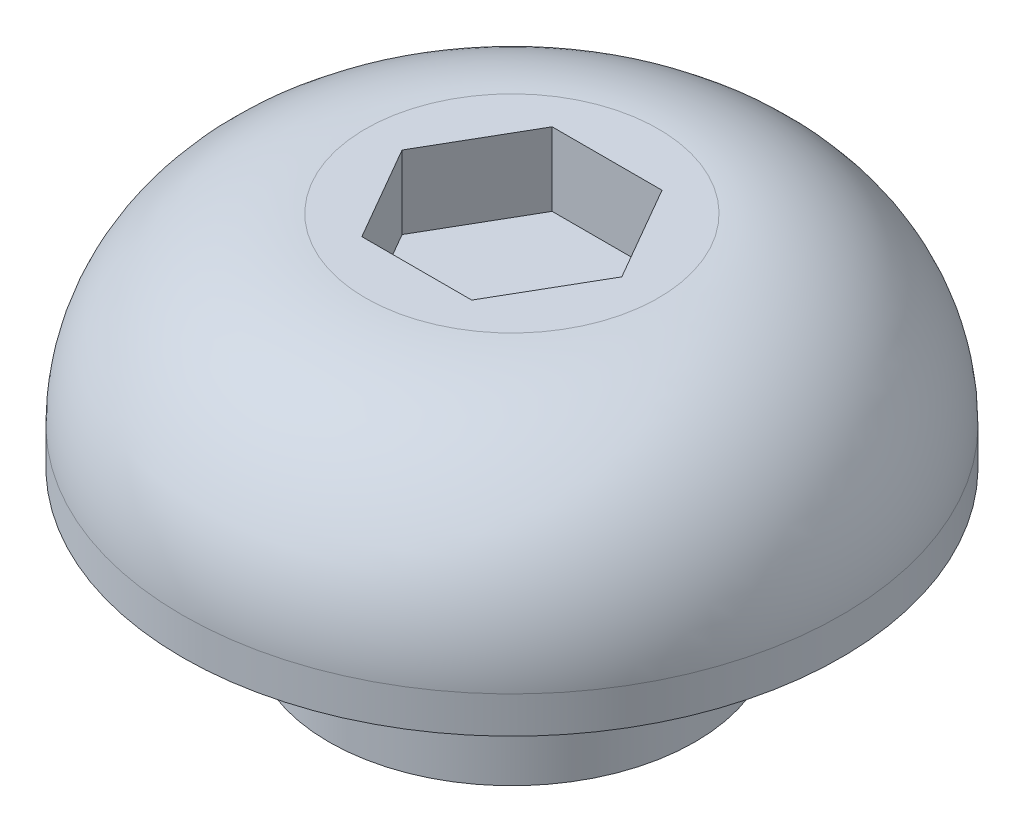
ISO-10303-21;
HEADER;
FILE_DESCRIPTION(('STEP AP214'),'2;1');
FILE_NAME('part.step','',(''),(''),'','','');
FILE_SCHEMA(('AUTOMOTIVE_DESIGN { 1 0 10303 214 1 1 1 1 }'));
ENDSEC;
DATA;
#1=APPLICATION_CONTEXT('core data for automotive mechanical design processes');
#2=APPLICATION_PROTOCOL_DEFINITION('international standard','automotive_design',2000,#1);
#3=PRODUCT_CONTEXT('',#1,'mechanical');
#4=PRODUCT('Part','Part','',(#3));
#5=PRODUCT_RELATED_PRODUCT_CATEGORY('part','',(#4));
#6=PRODUCT_DEFINITION_FORMATION('','',#4);
#7=PRODUCT_DEFINITION_CONTEXT('part definition',#1,'design');
#8=PRODUCT_DEFINITION('design','',#6,#7);
#9=PRODUCT_DEFINITION_SHAPE('','',#8);
#10=(LENGTH_UNIT() NAMED_UNIT(*) SI_UNIT(.MILLI.,.METRE.));
#11=(NAMED_UNIT(*) PLANE_ANGLE_UNIT() SI_UNIT($,.RADIAN.));
#12=(NAMED_UNIT(*) SI_UNIT($,.STERADIAN.) SOLID_ANGLE_UNIT());
#13=UNCERTAINTY_MEASURE_WITH_UNIT(LENGTH_MEASURE(1.E-05),#10,'distance_accuracy_value','');
#14=(GEOMETRIC_REPRESENTATION_CONTEXT(3) GLOBAL_UNCERTAINTY_ASSIGNED_CONTEXT((#13)) GLOBAL_UNIT_ASSIGNED_CONTEXT((#10,
#11,#12)) REPRESENTATION_CONTEXT('',''));
#15=CARTESIAN_POINT('',(0.,0.,0.));
#16=DIRECTION('',(0.,0.,1.));
#17=DIRECTION('',(1.,0.,0.));
#18=AXIS2_PLACEMENT_3D('',#15,#16,#17);
#19=CARTESIAN_POINT('',(0.,3.,0.));
#20=DIRECTION('',(0.,-1.,0.));
#21=DIRECTION('',(0.,0.,-1.));
#22=AXIS2_PLACEMENT_3D('',#19,#20,#21);
#23=CYLINDRICAL_SURFACE('',#22,4.5);
#24=CARTESIAN_POINT('',(0.,0.5,0.));
#25=DIRECTION('',(0.,1.,0.));
#26=DIRECTION('',(0.,0.,1.));
#27=AXIS2_PLACEMENT_3D('',#24,#25,#26);
#28=CIRCLE('',#27,4.5);
#29=CARTESIAN_POINT('',(0.,0.5,4.5));
#30=VERTEX_POINT('',#29);
#31=EDGE_CURVE('E36',#30,#30,#28,.F.);
#32=ORIENTED_EDGE('',*,*,#31,.T.);
#33=EDGE_LOOP('',(#32));
#34=FACE_BOUND('',#33,.T.);
#35=CARTESIAN_POINT('',(0.,0.,0.));
#36=DIRECTION('',(0.,1.,0.));
#37=DIRECTION('',(0.,0.,1.));
#38=AXIS2_PLACEMENT_3D('',#35,#36,#37);
#39=CIRCLE('',#38,4.5);
#40=CARTESIAN_POINT('',(0.,0.,4.5));
#41=VERTEX_POINT('',#40);
#42=EDGE_CURVE('E136',#41,#41,#39,.T.);
#43=ORIENTED_EDGE('',*,*,#42,.T.);
#44=EDGE_LOOP('',(#43));
#45=FACE_BOUND('',#44,.T.);
#46=ADVANCED_FACE('F32',(#34,#45),#23,.T.);
#47=CARTESIAN_POINT('',(0.,3.,0.));
#48=DIRECTION('',(0.,1.,0.));
#49=DIRECTION('',(0.,0.,1.));
#50=AXIS2_PLACEMENT_3D('',#47,#48,#49);
#51=PLANE('',#50);
#52=DIRECTION('',(0.5,0.,-0.866025403784439));
#53=VECTOR('',#52,1.);
#54=CARTESIAN_POINT('',(0.750000000000001,3.,1.29903810567666));
#55=LINE('',#54,#53);
#56=CARTESIAN_POINT('',(0.750000000000001,3.,1.29903810567666));
#57=VERTEX_POINT('',#56);
#58=CARTESIAN_POINT('',(1.5,3.,0.));
#59=VERTEX_POINT('',#58);
#60=EDGE_CURVE('E48',#57,#59,#55,.T.);
#61=ORIENTED_EDGE('',*,*,#60,.F.);
#62=DIRECTION('',(1.,0.,0.));
#63=VECTOR('',#62,1.);
#64=CARTESIAN_POINT('',(-0.750000000000001,3.,1.29903810567666));
#65=LINE('',#64,#63);
#66=CARTESIAN_POINT('',(-0.750000000000001,3.,1.29903810567666));
#67=VERTEX_POINT('',#66);
#68=EDGE_CURVE('E132',#67,#57,#65,.T.);
#69=ORIENTED_EDGE('',*,*,#68,.F.);
#70=DIRECTION('',(0.5,0.,0.866025403784439));
#71=VECTOR('',#70,1.);
#72=CARTESIAN_POINT('',(-1.5,3.,0.));
#73=LINE('',#72,#71);
#74=CARTESIAN_POINT('',(-1.5,3.,0.));
#75=VERTEX_POINT('',#74);
#76=EDGE_CURVE('E130',#75,#67,#73,.T.);
#77=ORIENTED_EDGE('',*,*,#76,.F.);
#78=DIRECTION('',(-0.5,0.,0.866025403784439));
#79=VECTOR('',#78,1.);
#80=CARTESIAN_POINT('',(-0.750000000000001,3.,-1.29903810567666));
#81=LINE('',#80,#79);
#82=CARTESIAN_POINT('',(-0.750000000000001,3.,-1.29903810567666));
#83=VERTEX_POINT('',#82);
#84=EDGE_CURVE('E96',#83,#75,#81,.T.);
#85=ORIENTED_EDGE('',*,*,#84,.F.);
#86=DIRECTION('',(-1.,0.,0.));
#87=VECTOR('',#86,1.);
#88=CARTESIAN_POINT('',(0.749999999999999,3.,-1.29903810567666));
#89=LINE('',#88,#87);
#90=CARTESIAN_POINT('',(0.749999999999999,3.,-1.29903810567666));
#91=VERTEX_POINT('',#90);
#92=EDGE_CURVE('E126',#91,#83,#89,.T.);
#93=ORIENTED_EDGE('',*,*,#92,.F.);
#94=DIRECTION('',(-0.5,0.,-0.866025403784439));
#95=VECTOR('',#94,1.);
#96=CARTESIAN_POINT('',(1.5,3.,0.));
#97=LINE('',#96,#95);
#98=EDGE_CURVE('E122',#59,#91,#97,.T.);
#99=ORIENTED_EDGE('',*,*,#98,.F.);
#100=EDGE_LOOP('',(#61,#69,#77,#85,#93,#99));
#101=FACE_BOUND('',#100,.T.);
#102=CARTESIAN_POINT('',(0.,3.,0.));
#103=DIRECTION('',(0.,1.,0.));
#104=DIRECTION('',(0.,0.,1.));
#105=AXIS2_PLACEMENT_3D('',#102,#103,#104);
#106=CIRCLE('',#105,2.);
#107=CARTESIAN_POINT('',(0.,3.,2.));
#108=VERTEX_POINT('',#107);
#109=EDGE_CURVE('E143',#108,#108,#106,.T.);
#110=ORIENTED_EDGE('',*,*,#109,.T.);
#111=EDGE_LOOP('',(#110));
#112=FACE_BOUND('',#111,.T.);
#113=ADVANCED_FACE('F162',(#101,#112),#51,.T.);
#114=CARTESIAN_POINT('',(0.,0.,0.));
#115=DIRECTION('',(0.,1.,0.));
#116=DIRECTION('',(0.,0.,1.));
#117=AXIS2_PLACEMENT_3D('',#114,#115,#116);
#118=PLANE('',#117);
#119=CARTESIAN_POINT('',(0.,0.,0.));
#120=DIRECTION('',(0.,-1.,0.));
#121=DIRECTION('',(0.,0.,-1.));
#122=AXIS2_PLACEMENT_3D('',#119,#120,#121);
#123=CIRCLE('',#122,2.5);
#124=CARTESIAN_POINT('',(0.,0.,-2.5));
#125=VERTEX_POINT('',#124);
#126=EDGE_CURVE('E11',#125,#125,#123,.T.);
#127=ORIENTED_EDGE('',*,*,#126,.F.);
#128=EDGE_LOOP('',(#127));
#129=FACE_BOUND('',#128,.T.);
#130=ORIENTED_EDGE('',*,*,#42,.F.);
#131=EDGE_LOOP('',(#130));
#132=FACE_BOUND('',#131,.T.);
#133=ADVANCED_FACE('F155',(#129,#132),#118,.F.);
#134=CARTESIAN_POINT('',(0.,0.5,0.));
#135=DIRECTION('',(0.,1.,0.));
#136=DIRECTION('',(0.,0.,1.));
#137=AXIS2_PLACEMENT_3D('',#134,#135,#136);
#138=DEGENERATE_TOROIDAL_SURFACE('',#137,2.,2.5,.T.);
#139=ORIENTED_EDGE('',*,*,#31,.F.);
#140=EDGE_LOOP('',(#139));
#141=FACE_BOUND('',#140,.T.);
#142=ORIENTED_EDGE('',*,*,#109,.F.);
#143=EDGE_LOOP('',(#142));
#144=FACE_BOUND('',#143,.T.);
#145=ADVANCED_FACE('F34',(#141,#144),#138,.T.);
#146=CARTESIAN_POINT('',(0.750000000000001,2.,1.29903810567666));
#147=DIRECTION('',(0.866025403784439,0.,0.5));
#148=DIRECTION('',(0.5,0.,-0.866025403784439));
#149=AXIS2_PLACEMENT_3D('',#146,#147,#148);
#150=PLANE('',#149);
#151=ORIENTED_EDGE('',*,*,#60,.T.);
#152=DIRECTION('',(0.,1.,0.));
#153=VECTOR('',#152,1.);
#154=CARTESIAN_POINT('',(1.5,2.,0.));
#155=LINE('',#154,#153);
#156=CARTESIAN_POINT('',(1.5,2.,0.));
#157=VERTEX_POINT('',#156);
#158=EDGE_CURVE('E78',#157,#59,#155,.T.);
#159=ORIENTED_EDGE('',*,*,#158,.F.);
#160=DIRECTION('',(0.5,0.,-0.866025403784439));
#161=VECTOR('',#160,1.);
#162=CARTESIAN_POINT('',(0.750000000000001,2.,1.29903810567666));
#163=LINE('',#162,#161);
#164=CARTESIAN_POINT('',(0.750000000000001,2.,1.29903810567666));
#165=VERTEX_POINT('',#164);
#166=EDGE_CURVE('E134',#165,#157,#163,.T.);
#167=ORIENTED_EDGE('',*,*,#166,.F.);
#168=DIRECTION('',(0.,1.,0.));
#169=VECTOR('',#168,1.);
#170=CARTESIAN_POINT('',(0.750000000000001,2.,1.29903810567666));
#171=LINE('',#170,#169);
#172=EDGE_CURVE('E56',#165,#57,#171,.T.);
#173=ORIENTED_EDGE('',*,*,#172,.T.);
#174=EDGE_LOOP('',(#151,#159,#167,#173));
#175=FACE_BOUND('',#174,.T.);
#176=ADVANCED_FACE('F154',(#175),#150,.F.);
#177=CARTESIAN_POINT('',(-0.750000000000001,2.,1.29903810567666));
#178=DIRECTION('',(0.,0.,1.));
#179=DIRECTION('',(1.,0.,0.));
#180=AXIS2_PLACEMENT_3D('',#177,#178,#179);
#181=PLANE('',#180);
#182=ORIENTED_EDGE('',*,*,#68,.T.);
#183=ORIENTED_EDGE('',*,*,#172,.F.);
#184=DIRECTION('',(1.,0.,0.));
#185=VECTOR('',#184,1.);
#186=CARTESIAN_POINT('',(-0.750000000000001,2.,1.29903810567666));
#187=LINE('',#186,#185);
#188=CARTESIAN_POINT('',(-0.750000000000001,2.,1.29903810567666));
#189=VERTEX_POINT('',#188);
#190=EDGE_CURVE('E108',#189,#165,#187,.T.);
#191=ORIENTED_EDGE('',*,*,#190,.F.);
#192=DIRECTION('',(0.,1.,0.));
#193=VECTOR('',#192,1.);
#194=CARTESIAN_POINT('',(-0.750000000000001,2.,1.29903810567666));
#195=LINE('',#194,#193);
#196=EDGE_CURVE('E100',#189,#67,#195,.T.);
#197=ORIENTED_EDGE('',*,*,#196,.T.);
#198=EDGE_LOOP('',(#182,#183,#191,#197));
#199=FACE_BOUND('',#198,.T.);
#200=ADVANCED_FACE('F160',(#199),#181,.F.);
#201=CARTESIAN_POINT('',(-1.5,2.,0.));
#202=DIRECTION('',(-0.866025403784439,0.,0.5));
#203=DIRECTION('',(0.5,0.,0.866025403784439));
#204=AXIS2_PLACEMENT_3D('',#201,#202,#203);
#205=PLANE('',#204);
#206=ORIENTED_EDGE('',*,*,#76,.T.);
#207=ORIENTED_EDGE('',*,*,#196,.F.);
#208=DIRECTION('',(0.5,0.,0.866025403784439));
#209=VECTOR('',#208,1.);
#210=CARTESIAN_POINT('',(-1.5,2.,0.));
#211=LINE('',#210,#209);
#212=CARTESIAN_POINT('',(-1.5,2.,0.));
#213=VERTEX_POINT('',#212);
#214=EDGE_CURVE('E104',#213,#189,#211,.T.);
#215=ORIENTED_EDGE('',*,*,#214,.F.);
#216=DIRECTION('',(0.,1.,0.));
#217=VECTOR('',#216,1.);
#218=CARTESIAN_POINT('',(-1.5,2.,0.));
#219=LINE('',#218,#217);
#220=EDGE_CURVE('E89',#213,#75,#219,.T.);
#221=ORIENTED_EDGE('',*,*,#220,.T.);
#222=EDGE_LOOP('',(#206,#207,#215,#221));
#223=FACE_BOUND('',#222,.T.);
#224=ADVANCED_FACE('F105',(#223),#205,.F.);
#225=CARTESIAN_POINT('',(-0.750000000000001,2.,-1.29903810567666));
#226=DIRECTION('',(-0.866025403784439,0.,-0.5));
#227=DIRECTION('',(-0.5,0.,0.866025403784439));
#228=AXIS2_PLACEMENT_3D('',#225,#226,#227);
#229=PLANE('',#228);
#230=ORIENTED_EDGE('',*,*,#84,.T.);
#231=ORIENTED_EDGE('',*,*,#220,.F.);
#232=DIRECTION('',(-0.5,0.,0.866025403784439));
#233=VECTOR('',#232,1.);
#234=CARTESIAN_POINT('',(-0.750000000000001,2.,-1.29903810567666));
#235=LINE('',#234,#233);
#236=CARTESIAN_POINT('',(-0.750000000000001,2.,-1.29903810567666));
#237=VERTEX_POINT('',#236);
#238=EDGE_CURVE('E93',#237,#213,#235,.T.);
#239=ORIENTED_EDGE('',*,*,#238,.F.);
#240=DIRECTION('',(0.,1.,0.));
#241=VECTOR('',#240,1.);
#242=CARTESIAN_POINT('',(-0.750000000000001,2.,-1.29903810567666));
#243=LINE('',#242,#241);
#244=EDGE_CURVE('E101',#237,#83,#243,.T.);
#245=ORIENTED_EDGE('',*,*,#244,.T.);
#246=EDGE_LOOP('',(#230,#231,#239,#245));
#247=FACE_BOUND('',#246,.T.);
#248=ADVANCED_FACE('F91',(#247),#229,.F.);
#249=CARTESIAN_POINT('',(0.749999999999999,2.,-1.29903810567666));
#250=DIRECTION('',(0.,0.,-1.));
#251=DIRECTION('',(-1.,0.,0.));
#252=AXIS2_PLACEMENT_3D('',#249,#250,#251);
#253=PLANE('',#252);
#254=ORIENTED_EDGE('',*,*,#92,.T.);
#255=ORIENTED_EDGE('',*,*,#244,.F.);
#256=DIRECTION('',(-1.,0.,0.));
#257=VECTOR('',#256,1.);
#258=CARTESIAN_POINT('',(0.749999999999999,2.,-1.29903810567666));
#259=LINE('',#258,#257);
#260=CARTESIAN_POINT('',(0.749999999999999,2.,-1.29903810567666));
#261=VERTEX_POINT('',#260);
#262=EDGE_CURVE('E114',#261,#237,#259,.T.);
#263=ORIENTED_EDGE('',*,*,#262,.F.);
#264=DIRECTION('',(0.,1.,0.));
#265=VECTOR('',#264,1.);
#266=CARTESIAN_POINT('',(0.749999999999999,2.,-1.29903810567666));
#267=LINE('',#266,#265);
#268=EDGE_CURVE('E139',#261,#91,#267,.T.);
#269=ORIENTED_EDGE('',*,*,#268,.T.);
#270=EDGE_LOOP('',(#254,#255,#263,#269));
#271=FACE_BOUND('',#270,.T.);
#272=ADVANCED_FACE('F175',(#271),#253,.F.);
#273=CARTESIAN_POINT('',(1.5,2.,0.));
#274=DIRECTION('',(0.866025403784439,0.,-0.5));
#275=DIRECTION('',(-0.5,0.,-0.866025403784439));
#276=AXIS2_PLACEMENT_3D('',#273,#274,#275);
#277=PLANE('',#276);
#278=ORIENTED_EDGE('',*,*,#98,.T.);
#279=ORIENTED_EDGE('',*,*,#268,.F.);
#280=DIRECTION('',(-0.5,0.,-0.866025403784439));
#281=VECTOR('',#280,1.);
#282=CARTESIAN_POINT('',(1.5,2.,0.));
#283=LINE('',#282,#281);
#284=EDGE_CURVE('E116',#157,#261,#283,.T.);
#285=ORIENTED_EDGE('',*,*,#284,.F.);
#286=ORIENTED_EDGE('',*,*,#158,.T.);
#287=EDGE_LOOP('',(#278,#279,#285,#286));
#288=FACE_BOUND('',#287,.T.);
#289=ADVANCED_FACE('F172',(#288),#277,.F.);
#290=CARTESIAN_POINT('',(0.,2.,0.));
#291=DIRECTION('',(0.,1.,0.));
#292=DIRECTION('',(0.,0.,1.));
#293=AXIS2_PLACEMENT_3D('',#290,#291,#292);
#294=PLANE('',#293);
#295=ORIENTED_EDGE('',*,*,#166,.T.);
#296=ORIENTED_EDGE('',*,*,#284,.T.);
#297=ORIENTED_EDGE('',*,*,#262,.T.);
#298=ORIENTED_EDGE('',*,*,#238,.T.);
#299=ORIENTED_EDGE('',*,*,#214,.T.);
#300=ORIENTED_EDGE('',*,*,#190,.T.);
#301=EDGE_LOOP('',(#295,#296,#297,#298,#299,#300));
#302=FACE_BOUND('',#301,.T.);
#303=ADVANCED_FACE('F111',(#302),#294,.T.);
#304=CARTESIAN_POINT('',(0.,-2.,0.));
#305=DIRECTION('',(0.,1.,0.));
#306=DIRECTION('',(0.,0.,1.));
#307=AXIS2_PLACEMENT_3D('',#304,#305,#306);
#308=CYLINDRICAL_SURFACE('',#307,2.5);
#309=CARTESIAN_POINT('',(0.,-2.,0.));
#310=DIRECTION('',(0.,-1.,0.));
#311=DIRECTION('',(0.,0.,-1.));
#312=AXIS2_PLACEMENT_3D('',#309,#310,#311);
#313=CIRCLE('',#312,2.5);
#314=CARTESIAN_POINT('',(0.,-2.,-2.5));
#315=VERTEX_POINT('',#314);
#316=EDGE_CURVE('E123',#315,#315,#313,.T.);
#317=ORIENTED_EDGE('',*,*,#316,.F.);
#318=EDGE_LOOP('',(#317));
#319=FACE_BOUND('',#318,.T.);
#320=ORIENTED_EDGE('',*,*,#126,.T.);
#321=EDGE_LOOP('',(#320));
#322=FACE_BOUND('',#321,.T.);
#323=ADVANCED_FACE('F188',(#319,#322),#308,.T.);
#324=CARTESIAN_POINT('',(0.,-2.,0.));
#325=DIRECTION('',(0.,-1.,0.));
#326=DIRECTION('',(0.,0.,-1.));
#327=AXIS2_PLACEMENT_3D('',#324,#325,#326);
#328=PLANE('',#327);
#329=ORIENTED_EDGE('',*,*,#316,.T.);
#330=EDGE_LOOP('',(#329));
#331=FACE_BOUND('',#330,.T.);
#332=ADVANCED_FACE('F191',(#331),#328,.T.);
#333=CLOSED_SHELL('',(#46,#113,#133,#145,#176,#200,#224,#248,#272,#289,#303,#323,#332));
#334=MANIFOLD_SOLID_BREP('B2',#333);
#335=ADVANCED_BREP_SHAPE_REPRESENTATION('',(#18,#334),#14);
#336=SHAPE_DEFINITION_REPRESENTATION(#9,#335);
ENDSEC;
END-ISO-10303-21;
